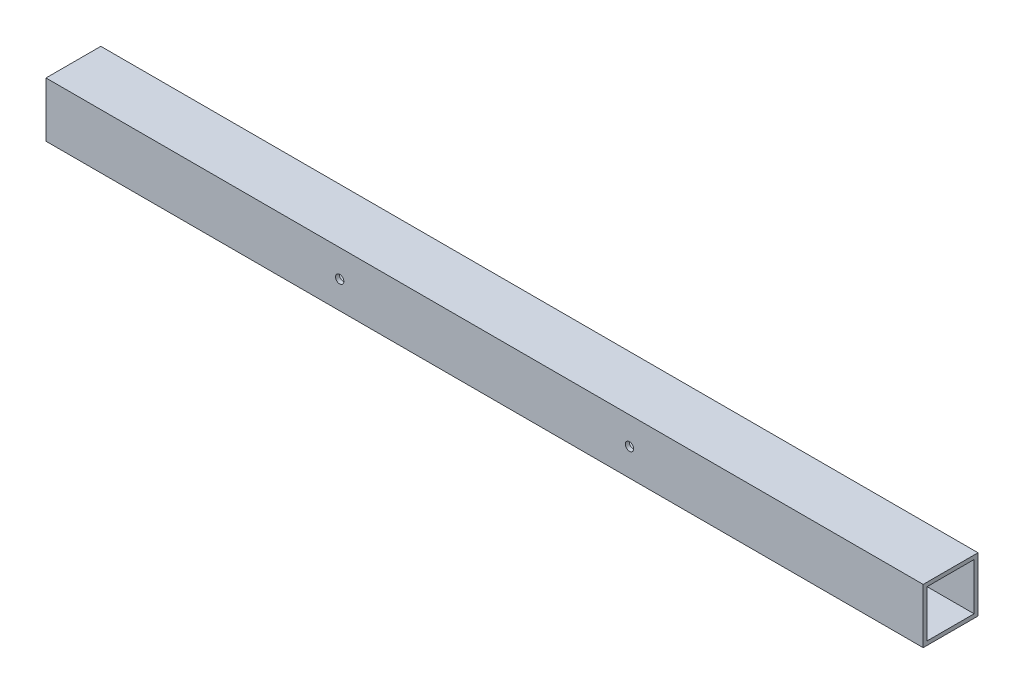
ISO-10303-21;
HEADER;
FILE_DESCRIPTION(('STEP AP214'),'2;1');
FILE_NAME('part.step','',(''),(''),'','','');
FILE_SCHEMA(('AUTOMOTIVE_DESIGN { 1 0 10303 214 1 1 1 1 }'));
ENDSEC;
DATA;
#1=APPLICATION_CONTEXT('core data for automotive mechanical design processes');
#2=APPLICATION_PROTOCOL_DEFINITION('international standard','automotive_design',2000,#1);
#3=PRODUCT_CONTEXT('',#1,'mechanical');
#4=PRODUCT('Part','Part','',(#3));
#5=PRODUCT_RELATED_PRODUCT_CATEGORY('part','',(#4));
#6=PRODUCT_DEFINITION_FORMATION('','',#4);
#7=PRODUCT_DEFINITION_CONTEXT('part definition',#1,'design');
#8=PRODUCT_DEFINITION('design','',#6,#7);
#9=PRODUCT_DEFINITION_SHAPE('','',#8);
#10=(LENGTH_UNIT() NAMED_UNIT(*) SI_UNIT(.MILLI.,.METRE.));
#11=(NAMED_UNIT(*) PLANE_ANGLE_UNIT() SI_UNIT($,.RADIAN.));
#12=(NAMED_UNIT(*) SI_UNIT($,.STERADIAN.) SOLID_ANGLE_UNIT());
#13=UNCERTAINTY_MEASURE_WITH_UNIT(LENGTH_MEASURE(1.E-05),#10,'distance_accuracy_value','');
#14=(GEOMETRIC_REPRESENTATION_CONTEXT(3) GLOBAL_UNCERTAINTY_ASSIGNED_CONTEXT((#13)) GLOBAL_UNIT_ASSIGNED_CONTEXT((#10,
#11,#12)) REPRESENTATION_CONTEXT('',''));
#15=CARTESIAN_POINT('',(0.,0.,0.));
#16=DIRECTION('',(0.,0.,1.));
#17=DIRECTION('',(1.,0.,0.));
#18=AXIS2_PLACEMENT_3D('',#15,#16,#17);
#19=CARTESIAN_POINT('',(-355.6,-22.2249999999999,-22.225));
#20=DIRECTION('',(0.,0.,-1.));
#21=DIRECTION('',(-1.,0.,0.));
#22=AXIS2_PLACEMENT_3D('',#19,#20,#21);
#23=PLANE('',#22);
#24=CARTESIAN_POINT('',(-117.475,0.,-22.225));
#25=DIRECTION('',(0.,0.,1.));
#26=DIRECTION('',(1.,0.,0.));
#27=AXIS2_PLACEMENT_3D('',#24,#25,#26);
#28=CIRCLE('',#27,3.37350099999999);
#29=CARTESIAN_POINT('',(-114.101499,0.,-22.225));
#30=VERTEX_POINT('',#29);
#31=EDGE_CURVE('E223',#30,#30,#28,.T.);
#32=ORIENTED_EDGE('',*,*,#31,.T.);
#33=EDGE_LOOP('',(#32));
#34=FACE_BOUND('',#33,.T.);
#35=CARTESIAN_POINT('',(117.475,0.,-22.225));
#36=DIRECTION('',(0.,0.,1.));
#37=DIRECTION('',(1.,0.,0.));
#38=AXIS2_PLACEMENT_3D('',#35,#36,#37);
#39=CIRCLE('',#38,3.37350099999999);
#40=CARTESIAN_POINT('',(120.848501,0.,-22.225));
#41=VERTEX_POINT('',#40);
#42=EDGE_CURVE('E202',#41,#41,#39,.T.);
#43=ORIENTED_EDGE('',*,*,#42,.T.);
#44=EDGE_LOOP('',(#43));
#45=FACE_BOUND('',#44,.T.);
#46=DIRECTION('',(1.,0.,0.));
#47=VECTOR('',#46,1.);
#48=CARTESIAN_POINT('',(-355.6,22.2249999999999,-22.225));
#49=LINE('',#48,#47);
#50=CARTESIAN_POINT('',(-355.6,22.2249999999999,-22.225));
#51=VERTEX_POINT('',#50);
#52=CARTESIAN_POINT('',(355.6,22.2249999999999,-22.225));
#53=VERTEX_POINT('',#52);
#54=EDGE_CURVE('E191',#51,#53,#49,.T.);
#55=ORIENTED_EDGE('',*,*,#54,.T.);
#56=DIRECTION('',(0.,1.,0.));
#57=VECTOR('',#56,1.);
#58=CARTESIAN_POINT('',(355.6,-22.2249999999999,-22.225));
#59=LINE('',#58,#57);
#60=CARTESIAN_POINT('',(355.6,-22.2249999999999,-22.225));
#61=VERTEX_POINT('',#60);
#62=EDGE_CURVE('E144',#61,#53,#59,.T.);
#63=ORIENTED_EDGE('',*,*,#62,.F.);
#64=DIRECTION('',(1.,0.,0.));
#65=VECTOR('',#64,1.);
#66=CARTESIAN_POINT('',(-355.6,-22.2249999999999,-22.225));
#67=LINE('',#66,#65);
#68=CARTESIAN_POINT('',(-355.6,-22.2249999999999,-22.225));
#69=VERTEX_POINT('',#68);
#70=EDGE_CURVE('E11',#69,#61,#67,.T.);
#71=ORIENTED_EDGE('',*,*,#70,.F.);
#72=DIRECTION('',(0.,1.,0.));
#73=VECTOR('',#72,1.);
#74=CARTESIAN_POINT('',(-355.6,-22.2249999999999,-22.225));
#75=LINE('',#74,#73);
#76=EDGE_CURVE('E172',#69,#51,#75,.T.);
#77=ORIENTED_EDGE('',*,*,#76,.T.);
#78=EDGE_LOOP('',(#55,#63,#71,#77));
#79=FACE_BOUND('',#78,.T.);
#80=ADVANCED_FACE('F40',(#34,#45,#79),#23,.T.);
#81=CARTESIAN_POINT('',(-355.6,-22.2249999999999,22.225));
#82=DIRECTION('',(0.,-1.,0.));
#83=DIRECTION('',(0.,0.,-1.));
#84=AXIS2_PLACEMENT_3D('',#81,#82,#83);
#85=PLANE('',#84);
#86=ORIENTED_EDGE('',*,*,#70,.T.);
#87=DIRECTION('',(0.,0.,-1.));
#88=VECTOR('',#87,1.);
#89=CARTESIAN_POINT('',(355.6,-22.2249999999999,22.225));
#90=LINE('',#89,#88);
#91=CARTESIAN_POINT('',(355.6,-22.2249999999999,22.225));
#92=VERTEX_POINT('',#91);
#93=EDGE_CURVE('E156',#92,#61,#90,.T.);
#94=ORIENTED_EDGE('',*,*,#93,.F.);
#95=DIRECTION('',(1.,0.,0.));
#96=VECTOR('',#95,1.);
#97=CARTESIAN_POINT('',(-355.6,-22.2249999999999,22.225));
#98=LINE('',#97,#96);
#99=CARTESIAN_POINT('',(-355.6,-22.2249999999999,22.225));
#100=VERTEX_POINT('',#99);
#101=EDGE_CURVE('E49',#100,#92,#98,.T.);
#102=ORIENTED_EDGE('',*,*,#101,.F.);
#103=DIRECTION('',(0.,0.,-1.));
#104=VECTOR('',#103,1.);
#105=CARTESIAN_POINT('',(-355.6,-22.2249999999999,22.225));
#106=LINE('',#105,#104);
#107=EDGE_CURVE('E188',#100,#69,#106,.T.);
#108=ORIENTED_EDGE('',*,*,#107,.T.);
#109=EDGE_LOOP('',(#86,#94,#102,#108));
#110=FACE_BOUND('',#109,.T.);
#111=ADVANCED_FACE('F240',(#110),#85,.T.);
#112=CARTESIAN_POINT('',(-355.6,-22.2249999999999,22.225));
#113=DIRECTION('',(0.,0.,1.));
#114=DIRECTION('',(1.,0.,0.));
#115=AXIS2_PLACEMENT_3D('',#112,#113,#114);
#116=PLANE('',#115);
#117=CARTESIAN_POINT('',(-117.475,0.,22.225));
#118=DIRECTION('',(0.,0.,1.));
#119=DIRECTION('',(1.,0.,0.));
#120=AXIS2_PLACEMENT_3D('',#117,#118,#119);
#121=CIRCLE('',#120,3.373501);
#122=CARTESIAN_POINT('',(-114.101499,0.,22.225));
#123=VERTEX_POINT('',#122);
#124=EDGE_CURVE('E227',#123,#123,#121,.T.);
#125=ORIENTED_EDGE('',*,*,#124,.F.);
#126=EDGE_LOOP('',(#125));
#127=FACE_BOUND('',#126,.T.);
#128=CARTESIAN_POINT('',(117.475,0.,22.225));
#129=DIRECTION('',(0.,0.,1.));
#130=DIRECTION('',(1.,0.,0.));
#131=AXIS2_PLACEMENT_3D('',#128,#129,#130);
#132=CIRCLE('',#131,3.373501);
#133=CARTESIAN_POINT('',(120.848501,0.,22.225));
#134=VERTEX_POINT('',#133);
#135=EDGE_CURVE('E210',#134,#134,#132,.T.);
#136=ORIENTED_EDGE('',*,*,#135,.F.);
#137=EDGE_LOOP('',(#136));
#138=FACE_BOUND('',#137,.T.);
#139=ORIENTED_EDGE('',*,*,#101,.T.);
#140=DIRECTION('',(0.,-1.,0.));
#141=VECTOR('',#140,1.);
#142=CARTESIAN_POINT('',(355.6,-22.2249999999999,22.225));
#143=LINE('',#142,#141);
#144=CARTESIAN_POINT('',(355.6,22.2249999999999,22.225));
#145=VERTEX_POINT('',#144);
#146=EDGE_CURVE('E152',#145,#92,#143,.T.);
#147=ORIENTED_EDGE('',*,*,#146,.F.);
#148=DIRECTION('',(1.,0.,0.));
#149=VECTOR('',#148,1.);
#150=CARTESIAN_POINT('',(-355.6,22.2249999999999,22.225));
#151=LINE('',#150,#149);
#152=CARTESIAN_POINT('',(-355.6,22.2249999999999,22.225));
#153=VERTEX_POINT('',#152);
#154=EDGE_CURVE('E195',#153,#145,#151,.T.);
#155=ORIENTED_EDGE('',*,*,#154,.F.);
#156=DIRECTION('',(0.,-1.,0.));
#157=VECTOR('',#156,1.);
#158=CARTESIAN_POINT('',(-355.6,-22.2249999999999,22.225));
#159=LINE('',#158,#157);
#160=EDGE_CURVE('E184',#153,#100,#159,.T.);
#161=ORIENTED_EDGE('',*,*,#160,.T.);
#162=EDGE_LOOP('',(#139,#147,#155,#161));
#163=FACE_BOUND('',#162,.T.);
#164=ADVANCED_FACE('F236',(#127,#138,#163),#116,.T.);
#165=CARTESIAN_POINT('',(-355.6,22.2249999999999,22.225));
#166=DIRECTION('',(0.,1.,0.));
#167=DIRECTION('',(0.,0.,1.));
#168=AXIS2_PLACEMENT_3D('',#165,#166,#167);
#169=PLANE('',#168);
#170=ORIENTED_EDGE('',*,*,#154,.T.);
#171=DIRECTION('',(0.,0.,1.));
#172=VECTOR('',#171,1.);
#173=CARTESIAN_POINT('',(355.6,22.2249999999999,22.225));
#174=LINE('',#173,#172);
#175=EDGE_CURVE('E148',#53,#145,#174,.T.);
#176=ORIENTED_EDGE('',*,*,#175,.F.);
#177=ORIENTED_EDGE('',*,*,#54,.F.);
#178=DIRECTION('',(0.,0.,1.));
#179=VECTOR('',#178,1.);
#180=CARTESIAN_POINT('',(-355.6,22.2249999999999,22.225));
#181=LINE('',#180,#179);
#182=EDGE_CURVE('E180',#51,#153,#181,.T.);
#183=ORIENTED_EDGE('',*,*,#182,.T.);
#184=EDGE_LOOP('',(#170,#176,#177,#183));
#185=FACE_BOUND('',#184,.T.);
#186=ADVANCED_FACE('F239',(#185),#169,.T.);
#187=CARTESIAN_POINT('',(-355.6,0.,0.));
#188=DIRECTION('',(-1.,0.,0.));
#189=DIRECTION('',(0.,0.,1.));
#190=AXIS2_PLACEMENT_3D('',#187,#188,#189);
#191=PLANE('',#190);
#192=DIRECTION('',(0.,1.,0.));
#193=VECTOR('',#192,1.);
#194=CARTESIAN_POINT('',(-355.6,-19.05,-19.05));
#195=LINE('',#194,#193);
#196=CARTESIAN_POINT('',(-355.6,-19.05,-19.05));
#197=VERTEX_POINT('',#196);
#198=CARTESIAN_POINT('',(-355.6,19.05,-19.05));
#199=VERTEX_POINT('',#198);
#200=EDGE_CURVE('E160',#197,#199,#195,.T.);
#201=ORIENTED_EDGE('',*,*,#200,.T.);
#202=DIRECTION('',(0.,0.,1.));
#203=VECTOR('',#202,1.);
#204=CARTESIAN_POINT('',(-355.6,19.05,19.05));
#205=LINE('',#204,#203);
#206=CARTESIAN_POINT('',(-355.6,19.05,19.05));
#207=VERTEX_POINT('',#206);
#208=EDGE_CURVE('E113',#199,#207,#205,.T.);
#209=ORIENTED_EDGE('',*,*,#208,.T.);
#210=DIRECTION('',(0.,-1.,0.));
#211=VECTOR('',#210,1.);
#212=CARTESIAN_POINT('',(-355.6,-19.05,19.05));
#213=LINE('',#212,#211);
#214=CARTESIAN_POINT('',(-355.6,-19.05,19.05));
#215=VERTEX_POINT('',#214);
#216=EDGE_CURVE('E57',#207,#215,#213,.T.);
#217=ORIENTED_EDGE('',*,*,#216,.T.);
#218=DIRECTION('',(0.,0.,-1.));
#219=VECTOR('',#218,1.);
#220=CARTESIAN_POINT('',(-355.6,-19.05,19.05));
#221=LINE('',#220,#219);
#222=EDGE_CURVE('E119',#215,#197,#221,.T.);
#223=ORIENTED_EDGE('',*,*,#222,.T.);
#224=EDGE_LOOP('',(#201,#209,#217,#223));
#225=FACE_BOUND('',#224,.T.);
#226=ORIENTED_EDGE('',*,*,#76,.F.);
#227=ORIENTED_EDGE('',*,*,#107,.F.);
#228=ORIENTED_EDGE('',*,*,#160,.F.);
#229=ORIENTED_EDGE('',*,*,#182,.F.);
#230=EDGE_LOOP('',(#226,#227,#228,#229));
#231=FACE_BOUND('',#230,.T.);
#232=ADVANCED_FACE('F252',(#225,#231),#191,.T.);
#233=CARTESIAN_POINT('',(-355.6,-19.05,-19.05));
#234=DIRECTION('',(0.,0.,-1.));
#235=DIRECTION('',(-1.,0.,0.));
#236=AXIS2_PLACEMENT_3D('',#233,#234,#235);
#237=PLANE('',#236);
#238=CARTESIAN_POINT('',(-117.475,0.,-19.05));
#239=DIRECTION('',(0.,0.,-1.));
#240=DIRECTION('',(-1.,0.,0.));
#241=AXIS2_PLACEMENT_3D('',#238,#239,#240);
#242=CIRCLE('',#241,3.37350099999999);
#243=CARTESIAN_POINT('',(-120.848501,0.,-19.05));
#244=VERTEX_POINT('',#243);
#245=EDGE_CURVE('E217',#244,#244,#242,.T.);
#246=ORIENTED_EDGE('',*,*,#245,.T.);
#247=EDGE_LOOP('',(#246));
#248=FACE_BOUND('',#247,.T.);
#249=CARTESIAN_POINT('',(117.475,0.,-19.05));
#250=DIRECTION('',(0.,0.,-1.));
#251=DIRECTION('',(-1.,0.,0.));
#252=AXIS2_PLACEMENT_3D('',#249,#250,#251);
#253=CIRCLE('',#252,3.37350099999999);
#254=CARTESIAN_POINT('',(114.101499,0.,-19.05));
#255=VERTEX_POINT('',#254);
#256=EDGE_CURVE('E199',#255,#255,#253,.T.);
#257=ORIENTED_EDGE('',*,*,#256,.T.);
#258=EDGE_LOOP('',(#257));
#259=FACE_BOUND('',#258,.T.);
#260=DIRECTION('',(1.,0.,0.));
#261=VECTOR('',#260,1.);
#262=CARTESIAN_POINT('',(-355.6,-19.05,-19.05));
#263=LINE('',#262,#261);
#264=CARTESIAN_POINT('',(355.6,-19.05,-19.05));
#265=VERTEX_POINT('',#264);
#266=EDGE_CURVE('E124',#197,#265,#263,.T.);
#267=ORIENTED_EDGE('',*,*,#266,.T.);
#268=DIRECTION('',(0.,1.,0.));
#269=VECTOR('',#268,1.);
#270=CARTESIAN_POINT('',(355.6,-19.05,-19.05));
#271=LINE('',#270,#269);
#272=CARTESIAN_POINT('',(355.6,19.05,-19.05));
#273=VERTEX_POINT('',#272);
#274=EDGE_CURVE('E122',#265,#273,#271,.T.);
#275=ORIENTED_EDGE('',*,*,#274,.T.);
#276=DIRECTION('',(1.,0.,0.));
#277=VECTOR('',#276,1.);
#278=CARTESIAN_POINT('',(-355.6,19.05,-19.05));
#279=LINE('',#278,#277);
#280=EDGE_CURVE('E106',#199,#273,#279,.T.);
#281=ORIENTED_EDGE('',*,*,#280,.F.);
#282=ORIENTED_EDGE('',*,*,#200,.F.);
#283=EDGE_LOOP('',(#267,#275,#281,#282));
#284=FACE_BOUND('',#283,.T.);
#285=ADVANCED_FACE('F123',(#248,#259,#284),#237,.F.);
#286=CARTESIAN_POINT('',(-355.6,-19.05,19.05));
#287=DIRECTION('',(0.,-1.,0.));
#288=DIRECTION('',(0.,0.,-1.));
#289=AXIS2_PLACEMENT_3D('',#286,#287,#288);
#290=PLANE('',#289);
#291=DIRECTION('',(1.,0.,0.));
#292=VECTOR('',#291,1.);
#293=CARTESIAN_POINT('',(-355.6,-19.05,19.05));
#294=LINE('',#293,#292);
#295=CARTESIAN_POINT('',(355.6,-19.05,19.05));
#296=VERTEX_POINT('',#295);
#297=EDGE_CURVE('E173',#215,#296,#294,.T.);
#298=ORIENTED_EDGE('',*,*,#297,.T.);
#299=DIRECTION('',(0.,0.,-1.));
#300=VECTOR('',#299,1.);
#301=CARTESIAN_POINT('',(355.6,-19.05,19.05));
#302=LINE('',#301,#300);
#303=EDGE_CURVE('E138',#296,#265,#302,.T.);
#304=ORIENTED_EDGE('',*,*,#303,.T.);
#305=ORIENTED_EDGE('',*,*,#266,.F.);
#306=ORIENTED_EDGE('',*,*,#222,.F.);
#307=EDGE_LOOP('',(#298,#304,#305,#306));
#308=FACE_BOUND('',#307,.T.);
#309=ADVANCED_FACE('F276',(#308),#290,.F.);
#310=CARTESIAN_POINT('',(-355.6,-19.05,19.05));
#311=DIRECTION('',(0.,0.,1.));
#312=DIRECTION('',(1.,0.,0.));
#313=AXIS2_PLACEMENT_3D('',#310,#311,#312);
#314=PLANE('',#313);
#315=CARTESIAN_POINT('',(-117.475,0.,19.05));
#316=DIRECTION('',(0.,0.,1.));
#317=DIRECTION('',(1.,0.,0.));
#318=AXIS2_PLACEMENT_3D('',#315,#316,#317);
#319=CIRCLE('',#318,3.37350099999999);
#320=CARTESIAN_POINT('',(-114.101499,0.,19.05));
#321=VERTEX_POINT('',#320);
#322=EDGE_CURVE('E43',#321,#321,#319,.T.);
#323=ORIENTED_EDGE('',*,*,#322,.T.);
#324=EDGE_LOOP('',(#323));
#325=FACE_BOUND('',#324,.T.);
#326=CARTESIAN_POINT('',(117.475,0.,19.05));
#327=DIRECTION('',(0.,0.,1.));
#328=DIRECTION('',(1.,0.,0.));
#329=AXIS2_PLACEMENT_3D('',#326,#327,#328);
#330=CIRCLE('',#329,3.37350099999999);
#331=CARTESIAN_POINT('',(120.848501,0.,19.05));
#332=VERTEX_POINT('',#331);
#333=EDGE_CURVE('E129',#332,#332,#330,.T.);
#334=ORIENTED_EDGE('',*,*,#333,.T.);
#335=EDGE_LOOP('',(#334));
#336=FACE_BOUND('',#335,.T.);
#337=DIRECTION('',(1.,0.,0.));
#338=VECTOR('',#337,1.);
#339=CARTESIAN_POINT('',(-355.6,19.05,19.05));
#340=LINE('',#339,#338);
#341=CARTESIAN_POINT('',(355.6,19.05,19.05));
#342=VERTEX_POINT('',#341);
#343=EDGE_CURVE('E118',#207,#342,#340,.T.);
#344=ORIENTED_EDGE('',*,*,#343,.T.);
#345=DIRECTION('',(0.,-1.,0.));
#346=VECTOR('',#345,1.);
#347=CARTESIAN_POINT('',(355.6,-19.05,19.05));
#348=LINE('',#347,#346);
#349=EDGE_CURVE('E133',#342,#296,#348,.T.);
#350=ORIENTED_EDGE('',*,*,#349,.T.);
#351=ORIENTED_EDGE('',*,*,#297,.F.);
#352=ORIENTED_EDGE('',*,*,#216,.F.);
#353=EDGE_LOOP('',(#344,#350,#351,#352));
#354=FACE_BOUND('',#353,.T.);
#355=ADVANCED_FACE('F281',(#325,#336,#354),#314,.F.);
#356=CARTESIAN_POINT('',(-355.6,19.05,19.05));
#357=DIRECTION('',(0.,1.,0.));
#358=DIRECTION('',(0.,0.,1.));
#359=AXIS2_PLACEMENT_3D('',#356,#357,#358);
#360=PLANE('',#359);
#361=ORIENTED_EDGE('',*,*,#280,.T.);
#362=DIRECTION('',(0.,0.,1.));
#363=VECTOR('',#362,1.);
#364=CARTESIAN_POINT('',(355.6,19.05,19.05));
#365=LINE('',#364,#363);
#366=EDGE_CURVE('E110',#273,#342,#365,.T.);
#367=ORIENTED_EDGE('',*,*,#366,.T.);
#368=ORIENTED_EDGE('',*,*,#343,.F.);
#369=ORIENTED_EDGE('',*,*,#208,.F.);
#370=EDGE_LOOP('',(#361,#367,#368,#369));
#371=FACE_BOUND('',#370,.T.);
#372=ADVANCED_FACE('F108',(#371),#360,.F.);
#373=CARTESIAN_POINT('',(355.6,0.,0.));
#374=DIRECTION('',(-1.,0.,0.));
#375=DIRECTION('',(0.,0.,1.));
#376=AXIS2_PLACEMENT_3D('',#373,#374,#375);
#377=PLANE('',#376);
#378=ORIENTED_EDGE('',*,*,#62,.T.);
#379=ORIENTED_EDGE('',*,*,#175,.T.);
#380=ORIENTED_EDGE('',*,*,#146,.T.);
#381=ORIENTED_EDGE('',*,*,#93,.T.);
#382=EDGE_LOOP('',(#378,#379,#380,#381));
#383=FACE_BOUND('',#382,.T.);
#384=ORIENTED_EDGE('',*,*,#274,.F.);
#385=ORIENTED_EDGE('',*,*,#303,.F.);
#386=ORIENTED_EDGE('',*,*,#349,.F.);
#387=ORIENTED_EDGE('',*,*,#366,.F.);
#388=EDGE_LOOP('',(#384,#385,#386,#387));
#389=FACE_BOUND('',#388,.T.);
#390=ADVANCED_FACE('F131',(#383,#389),#377,.F.);
#391=CARTESIAN_POINT('',(117.475,0.,22.225));
#392=DIRECTION('',(0.,0.,1.));
#393=DIRECTION('',(1.,0.,0.));
#394=AXIS2_PLACEMENT_3D('',#391,#392,#393);
#395=CYLINDRICAL_SURFACE('',#394,3.37350099999999);
#396=ORIENTED_EDGE('',*,*,#42,.F.);
#397=EDGE_LOOP('',(#396));
#398=FACE_BOUND('',#397,.T.);
#399=ORIENTED_EDGE('',*,*,#256,.F.);
#400=EDGE_LOOP('',(#399));
#401=FACE_BOUND('',#400,.T.);
#402=ADVANCED_FACE('F292',(#398,#401),#395,.F.);
#403=ORIENTED_EDGE('',*,*,#135,.T.);
#404=EDGE_LOOP('',(#403));
#405=FACE_BOUND('',#404,.T.);
#406=ORIENTED_EDGE('',*,*,#333,.F.);
#407=EDGE_LOOP('',(#406));
#408=FACE_BOUND('',#407,.T.);
#409=ADVANCED_FACE('F293',(#405,#408),#395,.F.);
#410=CARTESIAN_POINT('',(-117.475,0.,22.225));
#411=DIRECTION('',(0.,0.,1.));
#412=DIRECTION('',(1.,0.,0.));
#413=AXIS2_PLACEMENT_3D('',#410,#411,#412);
#414=CYLINDRICAL_SURFACE('',#413,3.37350099999999);
#415=ORIENTED_EDGE('',*,*,#124,.T.);
#416=EDGE_LOOP('',(#415));
#417=FACE_BOUND('',#416,.T.);
#418=ORIENTED_EDGE('',*,*,#322,.F.);
#419=EDGE_LOOP('',(#418));
#420=FACE_BOUND('',#419,.T.);
#421=ADVANCED_FACE('F233',(#417,#420),#414,.F.);
#422=ORIENTED_EDGE('',*,*,#31,.F.);
#423=EDGE_LOOP('',(#422));
#424=FACE_BOUND('',#423,.T.);
#425=ORIENTED_EDGE('',*,*,#245,.F.);
#426=EDGE_LOOP('',(#425));
#427=FACE_BOUND('',#426,.T.);
#428=ADVANCED_FACE('F269',(#424,#427),#414,.F.);
#429=CLOSED_SHELL('',(#80,#111,#164,#186,#232,#285,#309,#355,#372,#390,#402,#409,#421,#428));
#430=MANIFOLD_SOLID_BREP('B2',#429);
#431=ADVANCED_BREP_SHAPE_REPRESENTATION('',(#18,#430),#14);
#432=SHAPE_DEFINITION_REPRESENTATION(#9,#431);
ENDSEC;
END-ISO-10303-21;
